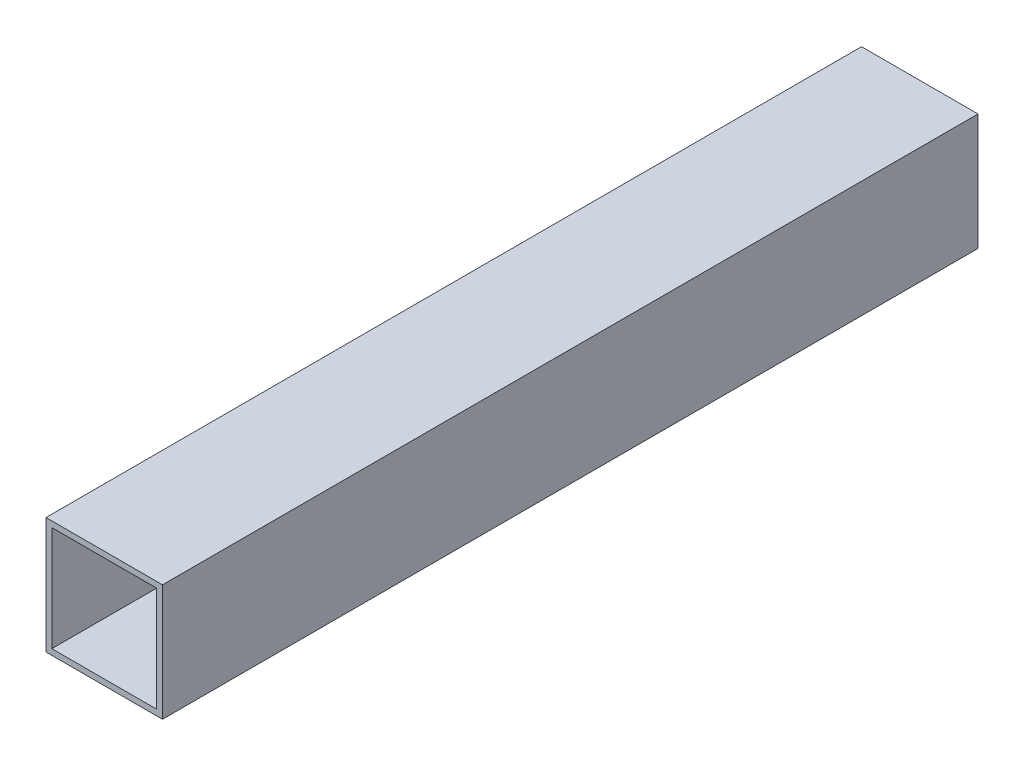
ISO-10303-21;
HEADER;
FILE_DESCRIPTION(('STEP AP214'),'2;1');
FILE_NAME('part.step','',(''),(''),'','','');
FILE_SCHEMA(('AUTOMOTIVE_DESIGN { 1 0 10303 214 1 1 1 1 }'));
ENDSEC;
DATA;
#1=APPLICATION_CONTEXT('core data for automotive mechanical design processes');
#2=APPLICATION_PROTOCOL_DEFINITION('international standard','automotive_design',2000,#1);
#3=PRODUCT_CONTEXT('',#1,'mechanical');
#4=PRODUCT('Part','Part','',(#3));
#5=PRODUCT_RELATED_PRODUCT_CATEGORY('part','',(#4));
#6=PRODUCT_DEFINITION_FORMATION('','',#4);
#7=PRODUCT_DEFINITION_CONTEXT('part definition',#1,'design');
#8=PRODUCT_DEFINITION('design','',#6,#7);
#9=PRODUCT_DEFINITION_SHAPE('','',#8);
#10=(LENGTH_UNIT() NAMED_UNIT(*) SI_UNIT(.MILLI.,.METRE.));
#11=(NAMED_UNIT(*) PLANE_ANGLE_UNIT() SI_UNIT($,.RADIAN.));
#12=(NAMED_UNIT(*) SI_UNIT($,.STERADIAN.) SOLID_ANGLE_UNIT());
#13=UNCERTAINTY_MEASURE_WITH_UNIT(LENGTH_MEASURE(1.E-05),#10,'distance_accuracy_value','');
#14=(GEOMETRIC_REPRESENTATION_CONTEXT(3) GLOBAL_UNCERTAINTY_ASSIGNED_CONTEXT((#13)) GLOBAL_UNIT_ASSIGNED_CONTEXT((#10,
#11,#12)) REPRESENTATION_CONTEXT('',''));
#15=CARTESIAN_POINT('',(0.,0.,0.));
#16=DIRECTION('',(0.,0.,1.));
#17=DIRECTION('',(1.,0.,0.));
#18=AXIS2_PLACEMENT_3D('',#15,#16,#17);
#19=CARTESIAN_POINT('',(0.,0.,177.8));
#20=DIRECTION('',(1.,0.,0.));
#21=DIRECTION('',(0.,0.,-1.));
#22=AXIS2_PLACEMENT_3D('',#19,#20,#21);
#23=PLANE('',#22);
#24=DIRECTION('',(0.,-1.,0.));
#25=VECTOR('',#24,1.);
#26=CARTESIAN_POINT('',(0.,0.,0.));
#27=LINE('',#26,#25);
#28=CARTESIAN_POINT('',(0.,25.4,0.));
#29=VERTEX_POINT('',#28);
#30=CARTESIAN_POINT('',(0.,0.,0.));
#31=VERTEX_POINT('',#30);
#32=EDGE_CURVE('E130',#29,#31,#27,.T.);
#33=ORIENTED_EDGE('',*,*,#32,.T.);
#34=DIRECTION('',(0.,0.,-1.));
#35=VECTOR('',#34,1.);
#36=CARTESIAN_POINT('',(0.,0.,177.8));
#37=LINE('',#36,#35);
#38=CARTESIAN_POINT('',(0.,0.,177.8));
#39=VERTEX_POINT('',#38);
#40=EDGE_CURVE('E11',#39,#31,#37,.T.);
#41=ORIENTED_EDGE('',*,*,#40,.F.);
#42=DIRECTION('',(0.,-1.,0.));
#43=VECTOR('',#42,1.);
#44=CARTESIAN_POINT('',(0.,0.,177.8));
#45=LINE('',#44,#43);
#46=CARTESIAN_POINT('',(0.,25.4,177.8));
#47=VERTEX_POINT('',#46);
#48=EDGE_CURVE('E134',#47,#39,#45,.T.);
#49=ORIENTED_EDGE('',*,*,#48,.F.);
#50=DIRECTION('',(0.,0.,-1.));
#51=VECTOR('',#50,1.);
#52=CARTESIAN_POINT('',(0.,25.4,177.8));
#53=LINE('',#52,#51);
#54=EDGE_CURVE('E144',#47,#29,#53,.T.);
#55=ORIENTED_EDGE('',*,*,#54,.T.);
#56=EDGE_LOOP('',(#33,#41,#49,#55));
#57=FACE_BOUND('',#56,.T.);
#58=ADVANCED_FACE('F33',(#57),#23,.F.);
#59=CARTESIAN_POINT('',(0.,0.,177.8));
#60=DIRECTION('',(0.,1.,0.));
#61=DIRECTION('',(0.,0.,1.));
#62=AXIS2_PLACEMENT_3D('',#59,#60,#61);
#63=PLANE('',#62);
#64=DIRECTION('',(1.,0.,0.));
#65=VECTOR('',#64,1.);
#66=CARTESIAN_POINT('',(0.,0.,0.));
#67=LINE('',#66,#65);
#68=CARTESIAN_POINT('',(25.4,0.,0.));
#69=VERTEX_POINT('',#68);
#70=EDGE_CURVE('E147',#31,#69,#67,.T.);
#71=ORIENTED_EDGE('',*,*,#70,.T.);
#72=DIRECTION('',(0.,0.,-1.));
#73=VECTOR('',#72,1.);
#74=CARTESIAN_POINT('',(25.4,0.,177.8));
#75=LINE('',#74,#73);
#76=CARTESIAN_POINT('',(25.4,0.,177.8));
#77=VERTEX_POINT('',#76);
#78=EDGE_CURVE('E40',#77,#69,#75,.T.);
#79=ORIENTED_EDGE('',*,*,#78,.F.);
#80=DIRECTION('',(1.,0.,0.));
#81=VECTOR('',#80,1.);
#82=CARTESIAN_POINT('',(0.,0.,177.8));
#83=LINE('',#82,#81);
#84=EDGE_CURVE('E137',#39,#77,#83,.T.);
#85=ORIENTED_EDGE('',*,*,#84,.F.);
#86=ORIENTED_EDGE('',*,*,#40,.T.);
#87=EDGE_LOOP('',(#71,#79,#85,#86));
#88=FACE_BOUND('',#87,.T.);
#89=ADVANCED_FACE('F175',(#88),#63,.F.);
#90=CARTESIAN_POINT('',(25.4,0.,177.8));
#91=DIRECTION('',(-1.,0.,0.));
#92=DIRECTION('',(0.,0.,1.));
#93=AXIS2_PLACEMENT_3D('',#90,#91,#92);
#94=PLANE('',#93);
#95=DIRECTION('',(0.,1.,0.));
#96=VECTOR('',#95,1.);
#97=CARTESIAN_POINT('',(25.4,0.,0.));
#98=LINE('',#97,#96);
#99=CARTESIAN_POINT('',(25.4,25.4,0.));
#100=VERTEX_POINT('',#99);
#101=EDGE_CURVE('E149',#69,#100,#98,.T.);
#102=ORIENTED_EDGE('',*,*,#101,.T.);
#103=DIRECTION('',(0.,0.,-1.));
#104=VECTOR('',#103,1.);
#105=CARTESIAN_POINT('',(25.4,25.4,177.8));
#106=LINE('',#105,#104);
#107=CARTESIAN_POINT('',(25.4,25.4,177.8));
#108=VERTEX_POINT('',#107);
#109=EDGE_CURVE('E154',#108,#100,#106,.T.);
#110=ORIENTED_EDGE('',*,*,#109,.F.);
#111=DIRECTION('',(0.,1.,0.));
#112=VECTOR('',#111,1.);
#113=CARTESIAN_POINT('',(25.4,0.,177.8));
#114=LINE('',#113,#112);
#115=EDGE_CURVE('E140',#77,#108,#114,.T.);
#116=ORIENTED_EDGE('',*,*,#115,.F.);
#117=ORIENTED_EDGE('',*,*,#78,.T.);
#118=EDGE_LOOP('',(#102,#110,#116,#117));
#119=FACE_BOUND('',#118,.T.);
#120=ADVANCED_FACE('F161',(#119),#94,.F.);
#121=CARTESIAN_POINT('',(0.,25.4,177.8));
#122=DIRECTION('',(0.,-1.,0.));
#123=DIRECTION('',(0.,0.,-1.));
#124=AXIS2_PLACEMENT_3D('',#121,#122,#123);
#125=PLANE('',#124);
#126=DIRECTION('',(-1.,0.,0.));
#127=VECTOR('',#126,1.);
#128=CARTESIAN_POINT('',(0.,25.4,0.));
#129=LINE('',#128,#127);
#130=EDGE_CURVE('E138',#100,#29,#129,.T.);
#131=ORIENTED_EDGE('',*,*,#130,.T.);
#132=ORIENTED_EDGE('',*,*,#54,.F.);
#133=DIRECTION('',(-1.,0.,0.));
#134=VECTOR('',#133,1.);
#135=CARTESIAN_POINT('',(0.,25.4,177.8));
#136=LINE('',#135,#134);
#137=EDGE_CURVE('E142',#108,#47,#136,.T.);
#138=ORIENTED_EDGE('',*,*,#137,.F.);
#139=ORIENTED_EDGE('',*,*,#109,.T.);
#140=EDGE_LOOP('',(#131,#132,#138,#139));
#141=FACE_BOUND('',#140,.T.);
#142=ADVANCED_FACE('F168',(#141),#125,.F.);
#143=CARTESIAN_POINT('',(0.,0.,177.8));
#144=DIRECTION('',(0.,0.,-1.));
#145=DIRECTION('',(-1.,0.,0.));
#146=AXIS2_PLACEMENT_3D('',#143,#144,#145);
#147=PLANE('',#146);
#148=DIRECTION('',(1.,0.,0.));
#149=VECTOR('',#148,1.);
#150=CARTESIAN_POINT('',(1.27,1.27,177.8));
#151=LINE('',#150,#149);
#152=CARTESIAN_POINT('',(1.27,1.27,177.8));
#153=VERTEX_POINT('',#152);
#154=CARTESIAN_POINT('',(24.13,1.27,177.8));
#155=VERTEX_POINT('',#154);
#156=EDGE_CURVE('E124',#153,#155,#151,.T.);
#157=ORIENTED_EDGE('',*,*,#156,.F.);
#158=DIRECTION('',(0.,-1.,0.));
#159=VECTOR('',#158,1.);
#160=CARTESIAN_POINT('',(1.27,24.13,177.8));
#161=LINE('',#160,#159);
#162=CARTESIAN_POINT('',(1.27,24.13,177.8));
#163=VERTEX_POINT('',#162);
#164=EDGE_CURVE('E47',#163,#153,#161,.T.);
#165=ORIENTED_EDGE('',*,*,#164,.F.);
#166=DIRECTION('',(-1.,0.,0.));
#167=VECTOR('',#166,1.);
#168=CARTESIAN_POINT('',(1.27,24.13,177.8));
#169=LINE('',#168,#167);
#170=CARTESIAN_POINT('',(24.13,24.13,177.8));
#171=VERTEX_POINT('',#170);
#172=EDGE_CURVE('E115',#171,#163,#169,.T.);
#173=ORIENTED_EDGE('',*,*,#172,.F.);
#174=DIRECTION('',(0.,1.,0.));
#175=VECTOR('',#174,1.);
#176=CARTESIAN_POINT('',(24.13,24.13,177.8));
#177=LINE('',#176,#175);
#178=EDGE_CURVE('E118',#155,#171,#177,.T.);
#179=ORIENTED_EDGE('',*,*,#178,.F.);
#180=EDGE_LOOP('',(#157,#165,#173,#179));
#181=FACE_BOUND('',#180,.T.);
#182=ORIENTED_EDGE('',*,*,#48,.T.);
#183=ORIENTED_EDGE('',*,*,#84,.T.);
#184=ORIENTED_EDGE('',*,*,#115,.T.);
#185=ORIENTED_EDGE('',*,*,#137,.T.);
#186=EDGE_LOOP('',(#182,#183,#184,#185));
#187=FACE_BOUND('',#186,.T.);
#188=ADVANCED_FACE('F174',(#181,#187),#147,.F.);
#189=CARTESIAN_POINT('',(0.,0.,0.));
#190=DIRECTION('',(0.,0.,-1.));
#191=DIRECTION('',(-1.,0.,0.));
#192=AXIS2_PLACEMENT_3D('',#189,#190,#191);
#193=PLANE('',#192);
#194=DIRECTION('',(0.,-1.,0.));
#195=VECTOR('',#194,1.);
#196=CARTESIAN_POINT('',(1.27,24.13,0.));
#197=LINE('',#196,#195);
#198=CARTESIAN_POINT('',(1.27,24.13,0.));
#199=VERTEX_POINT('',#198);
#200=CARTESIAN_POINT('',(1.27,1.27,0.));
#201=VERTEX_POINT('',#200);
#202=EDGE_CURVE('E99',#199,#201,#197,.T.);
#203=ORIENTED_EDGE('',*,*,#202,.T.);
#204=DIRECTION('',(1.,0.,0.));
#205=VECTOR('',#204,1.);
#206=CARTESIAN_POINT('',(1.27,1.27,0.));
#207=LINE('',#206,#205);
#208=CARTESIAN_POINT('',(24.13,1.27,0.));
#209=VERTEX_POINT('',#208);
#210=EDGE_CURVE('E108',#201,#209,#207,.T.);
#211=ORIENTED_EDGE('',*,*,#210,.T.);
#212=DIRECTION('',(0.,1.,0.));
#213=VECTOR('',#212,1.);
#214=CARTESIAN_POINT('',(24.13,24.13,0.));
#215=LINE('',#214,#213);
#216=CARTESIAN_POINT('',(24.13,24.13,0.));
#217=VERTEX_POINT('',#216);
#218=EDGE_CURVE('E55',#209,#217,#215,.T.);
#219=ORIENTED_EDGE('',*,*,#218,.T.);
#220=DIRECTION('',(-1.,0.,0.));
#221=VECTOR('',#220,1.);
#222=CARTESIAN_POINT('',(1.27,24.13,0.));
#223=LINE('',#222,#221);
#224=EDGE_CURVE('E105',#217,#199,#223,.T.);
#225=ORIENTED_EDGE('',*,*,#224,.T.);
#226=EDGE_LOOP('',(#203,#211,#219,#225));
#227=FACE_BOUND('',#226,.T.);
#228=ORIENTED_EDGE('',*,*,#32,.F.);
#229=ORIENTED_EDGE('',*,*,#130,.F.);
#230=ORIENTED_EDGE('',*,*,#101,.F.);
#231=ORIENTED_EDGE('',*,*,#70,.F.);
#232=EDGE_LOOP('',(#228,#229,#230,#231));
#233=FACE_BOUND('',#232,.T.);
#234=ADVANCED_FACE('F112',(#227,#233),#193,.T.);
#235=CARTESIAN_POINT('',(1.27,24.13,0.));
#236=DIRECTION('',(-1.,0.,0.));
#237=DIRECTION('',(0.,-1.,0.));
#238=AXIS2_PLACEMENT_3D('',#235,#236,#237);
#239=PLANE('',#238);
#240=ORIENTED_EDGE('',*,*,#164,.T.);
#241=DIRECTION('',(0.,0.,1.));
#242=VECTOR('',#241,1.);
#243=CARTESIAN_POINT('',(1.27,1.27,0.));
#244=LINE('',#243,#242);
#245=EDGE_CURVE('E95',#201,#153,#244,.T.);
#246=ORIENTED_EDGE('',*,*,#245,.F.);
#247=ORIENTED_EDGE('',*,*,#202,.F.);
#248=DIRECTION('',(0.,0.,1.));
#249=VECTOR('',#248,1.);
#250=CARTESIAN_POINT('',(1.27,24.13,0.));
#251=LINE('',#250,#249);
#252=EDGE_CURVE('E128',#199,#163,#251,.T.);
#253=ORIENTED_EDGE('',*,*,#252,.T.);
#254=EDGE_LOOP('',(#240,#246,#247,#253));
#255=FACE_BOUND('',#254,.T.);
#256=ADVANCED_FACE('F97',(#255),#239,.F.);
#257=CARTESIAN_POINT('',(1.27,24.13,0.));
#258=DIRECTION('',(0.,1.,0.));
#259=DIRECTION('',(0.,0.,1.));
#260=AXIS2_PLACEMENT_3D('',#257,#258,#259);
#261=PLANE('',#260);
#262=ORIENTED_EDGE('',*,*,#172,.T.);
#263=ORIENTED_EDGE('',*,*,#252,.F.);
#264=ORIENTED_EDGE('',*,*,#224,.F.);
#265=DIRECTION('',(0.,0.,1.));
#266=VECTOR('',#265,1.);
#267=CARTESIAN_POINT('',(24.13,24.13,0.));
#268=LINE('',#267,#266);
#269=EDGE_CURVE('E131',#217,#171,#268,.T.);
#270=ORIENTED_EDGE('',*,*,#269,.T.);
#271=EDGE_LOOP('',(#262,#263,#264,#270));
#272=FACE_BOUND('',#271,.T.);
#273=ADVANCED_FACE('F192',(#272),#261,.F.);
#274=CARTESIAN_POINT('',(24.13,24.13,0.));
#275=DIRECTION('',(1.,0.,0.));
#276=DIRECTION('',(0.,0.,-1.));
#277=AXIS2_PLACEMENT_3D('',#274,#275,#276);
#278=PLANE('',#277);
#279=ORIENTED_EDGE('',*,*,#178,.T.);
#280=ORIENTED_EDGE('',*,*,#269,.F.);
#281=ORIENTED_EDGE('',*,*,#218,.F.);
#282=DIRECTION('',(0.,0.,1.));
#283=VECTOR('',#282,1.);
#284=CARTESIAN_POINT('',(24.13,1.27,0.));
#285=LINE('',#284,#283);
#286=EDGE_CURVE('E104',#209,#155,#285,.T.);
#287=ORIENTED_EDGE('',*,*,#286,.T.);
#288=EDGE_LOOP('',(#279,#280,#281,#287));
#289=FACE_BOUND('',#288,.T.);
#290=ADVANCED_FACE('F195',(#289),#278,.F.);
#291=CARTESIAN_POINT('',(1.27,1.27,0.));
#292=DIRECTION('',(0.,-1.,0.));
#293=DIRECTION('',(0.,0.,-1.));
#294=AXIS2_PLACEMENT_3D('',#291,#292,#293);
#295=PLANE('',#294);
#296=ORIENTED_EDGE('',*,*,#156,.T.);
#297=ORIENTED_EDGE('',*,*,#286,.F.);
#298=ORIENTED_EDGE('',*,*,#210,.F.);
#299=ORIENTED_EDGE('',*,*,#245,.T.);
#300=EDGE_LOOP('',(#296,#297,#298,#299));
#301=FACE_BOUND('',#300,.T.);
#302=ADVANCED_FACE('F109',(#301),#295,.F.);
#303=CLOSED_SHELL('',(#58,#89,#120,#142,#188,#234,#256,#273,#290,#302));
#304=MANIFOLD_SOLID_BREP('B2',#303);
#305=ADVANCED_BREP_SHAPE_REPRESENTATION('',(#18,#304),#14);
#306=SHAPE_DEFINITION_REPRESENTATION(#9,#305);
ENDSEC;
END-ISO-10303-21;
